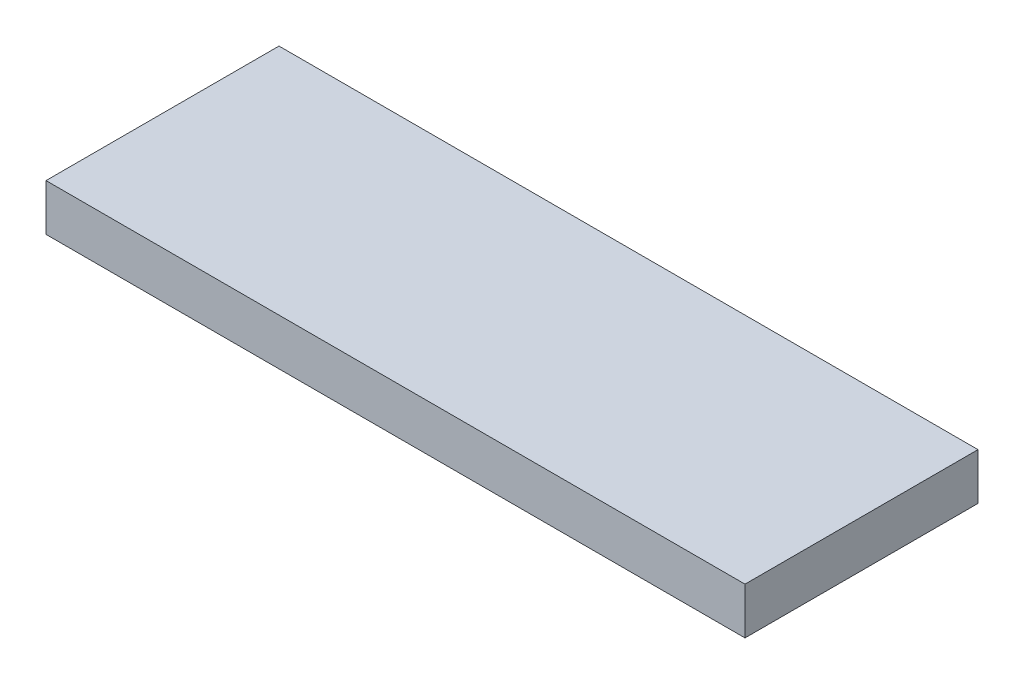
ISO-10303-21;
HEADER;
FILE_DESCRIPTION(('STEP AP214'),'2;1');
FILE_NAME('part.step','',(''),(''),'','','');
FILE_SCHEMA(('AUTOMOTIVE_DESIGN { 1 0 10303 214 1 1 1 1 }'));
ENDSEC;
DATA;
#1=APPLICATION_CONTEXT('core data for automotive mechanical design processes');
#2=APPLICATION_PROTOCOL_DEFINITION('international standard','automotive_design',2000,#1);
#3=PRODUCT_CONTEXT('',#1,'mechanical');
#4=PRODUCT('Part','Part','',(#3));
#5=PRODUCT_RELATED_PRODUCT_CATEGORY('part','',(#4));
#6=PRODUCT_DEFINITION_FORMATION('','',#4);
#7=PRODUCT_DEFINITION_CONTEXT('part definition',#1,'design');
#8=PRODUCT_DEFINITION('design','',#6,#7);
#9=PRODUCT_DEFINITION_SHAPE('','',#8);
#10=(LENGTH_UNIT() NAMED_UNIT(*) SI_UNIT(.MILLI.,.METRE.));
#11=(NAMED_UNIT(*) PLANE_ANGLE_UNIT() SI_UNIT($,.RADIAN.));
#12=(NAMED_UNIT(*) SI_UNIT($,.STERADIAN.) SOLID_ANGLE_UNIT());
#13=UNCERTAINTY_MEASURE_WITH_UNIT(LENGTH_MEASURE(1.E-05),#10,'distance_accuracy_value','');
#14=(GEOMETRIC_REPRESENTATION_CONTEXT(3) GLOBAL_UNCERTAINTY_ASSIGNED_CONTEXT((#13)) GLOBAL_UNIT_ASSIGNED_CONTEXT((#10,
#11,#12)) REPRESENTATION_CONTEXT('',''));
#15=CARTESIAN_POINT('',(0.,0.,0.));
#16=DIRECTION('',(0.,0.,1.));
#17=DIRECTION('',(1.,0.,0.));
#18=AXIS2_PLACEMENT_3D('',#15,#16,#17);
#19=CARTESIAN_POINT('',(-15.,2.,5.));
#20=DIRECTION('',(1.,0.,0.));
#21=DIRECTION('',(0.,0.,-1.));
#22=AXIS2_PLACEMENT_3D('',#19,#20,#21);
#23=PLANE('',#22);
#24=DIRECTION('',(0.,0.,1.));
#25=VECTOR('',#24,1.);
#26=CARTESIAN_POINT('',(-15.,0.,5.));
#27=LINE('',#26,#25);
#28=CARTESIAN_POINT('',(-15.,0.,-5.));
#29=VERTEX_POINT('',#28);
#30=CARTESIAN_POINT('',(-15.,0.,5.));
#31=VERTEX_POINT('',#30);
#32=EDGE_CURVE('E96',#29,#31,#27,.T.);
#33=ORIENTED_EDGE('',*,*,#32,.T.);
#34=DIRECTION('',(0.,-1.,0.));
#35=VECTOR('',#34,1.);
#36=CARTESIAN_POINT('',(-15.,2.,5.));
#37=LINE('',#36,#35);
#38=CARTESIAN_POINT('',(-15.,2.,5.));
#39=VERTEX_POINT('',#38);
#40=EDGE_CURVE('E11',#39,#31,#37,.T.);
#41=ORIENTED_EDGE('',*,*,#40,.F.);
#42=DIRECTION('',(0.,0.,1.));
#43=VECTOR('',#42,1.);
#44=CARTESIAN_POINT('',(-15.,2.,5.));
#45=LINE('',#44,#43);
#46=CARTESIAN_POINT('',(-15.,2.,-5.));
#47=VERTEX_POINT('',#46);
#48=EDGE_CURVE('E84',#47,#39,#45,.T.);
#49=ORIENTED_EDGE('',*,*,#48,.F.);
#50=DIRECTION('',(0.,-1.,0.));
#51=VECTOR('',#50,1.);
#52=CARTESIAN_POINT('',(-15.,2.,-5.));
#53=LINE('',#52,#51);
#54=EDGE_CURVE('E92',#47,#29,#53,.T.);
#55=ORIENTED_EDGE('',*,*,#54,.T.);
#56=EDGE_LOOP('',(#33,#41,#49,#55));
#57=FACE_BOUND('',#56,.T.);
#58=ADVANCED_FACE('F33',(#57),#23,.F.);
#59=CARTESIAN_POINT('',(15.,2.,5.));
#60=DIRECTION('',(0.,0.,-1.));
#61=DIRECTION('',(-1.,0.,0.));
#62=AXIS2_PLACEMENT_3D('',#59,#60,#61);
#63=PLANE('',#62);
#64=DIRECTION('',(1.,0.,0.));
#65=VECTOR('',#64,1.);
#66=CARTESIAN_POINT('',(15.,0.,5.));
#67=LINE('',#66,#65);
#68=CARTESIAN_POINT('',(15.,0.,5.));
#69=VERTEX_POINT('',#68);
#70=EDGE_CURVE('E88',#31,#69,#67,.T.);
#71=ORIENTED_EDGE('',*,*,#70,.T.);
#72=DIRECTION('',(0.,-1.,0.));
#73=VECTOR('',#72,1.);
#74=CARTESIAN_POINT('',(15.,2.,5.));
#75=LINE('',#74,#73);
#76=CARTESIAN_POINT('',(15.,2.,5.));
#77=VERTEX_POINT('',#76);
#78=EDGE_CURVE('E41',#77,#69,#75,.T.);
#79=ORIENTED_EDGE('',*,*,#78,.F.);
#80=DIRECTION('',(1.,0.,0.));
#81=VECTOR('',#80,1.);
#82=CARTESIAN_POINT('',(15.,2.,5.));
#83=LINE('',#82,#81);
#84=EDGE_CURVE('E79',#39,#77,#83,.T.);
#85=ORIENTED_EDGE('',*,*,#84,.F.);
#86=ORIENTED_EDGE('',*,*,#40,.T.);
#87=EDGE_LOOP('',(#71,#79,#85,#86));
#88=FACE_BOUND('',#87,.T.);
#89=ADVANCED_FACE('F87',(#88),#63,.F.);
#90=CARTESIAN_POINT('',(15.,2.,5.));
#91=DIRECTION('',(-1.,0.,0.));
#92=DIRECTION('',(0.,0.,1.));
#93=AXIS2_PLACEMENT_3D('',#90,#91,#92);
#94=PLANE('',#93);
#95=DIRECTION('',(0.,0.,-1.));
#96=VECTOR('',#95,1.);
#97=CARTESIAN_POINT('',(15.,0.,5.));
#98=LINE('',#97,#96);
#99=CARTESIAN_POINT('',(15.,0.,-5.));
#100=VERTEX_POINT('',#99);
#101=EDGE_CURVE('E66',#69,#100,#98,.T.);
#102=ORIENTED_EDGE('',*,*,#101,.T.);
#103=DIRECTION('',(0.,-1.,0.));
#104=VECTOR('',#103,1.);
#105=CARTESIAN_POINT('',(15.,2.,-5.));
#106=LINE('',#105,#104);
#107=CARTESIAN_POINT('',(15.,2.,-5.));
#108=VERTEX_POINT('',#107);
#109=EDGE_CURVE('E89',#108,#100,#106,.T.);
#110=ORIENTED_EDGE('',*,*,#109,.F.);
#111=DIRECTION('',(0.,0.,-1.));
#112=VECTOR('',#111,1.);
#113=CARTESIAN_POINT('',(15.,2.,5.));
#114=LINE('',#113,#112);
#115=EDGE_CURVE('E82',#77,#108,#114,.T.);
#116=ORIENTED_EDGE('',*,*,#115,.F.);
#117=ORIENTED_EDGE('',*,*,#78,.T.);
#118=EDGE_LOOP('',(#102,#110,#116,#117));
#119=FACE_BOUND('',#118,.T.);
#120=ADVANCED_FACE('F90',(#119),#94,.F.);
#121=CARTESIAN_POINT('',(15.,2.,-5.));
#122=DIRECTION('',(0.,0.,1.));
#123=DIRECTION('',(1.,0.,0.));
#124=AXIS2_PLACEMENT_3D('',#121,#122,#123);
#125=PLANE('',#124);
#126=DIRECTION('',(-1.,0.,0.));
#127=VECTOR('',#126,1.);
#128=CARTESIAN_POINT('',(15.,0.,-5.));
#129=LINE('',#128,#127);
#130=EDGE_CURVE('E72',#100,#29,#129,.T.);
#131=ORIENTED_EDGE('',*,*,#130,.T.);
#132=ORIENTED_EDGE('',*,*,#54,.F.);
#133=DIRECTION('',(-1.,0.,0.));
#134=VECTOR('',#133,1.);
#135=CARTESIAN_POINT('',(15.,2.,-5.));
#136=LINE('',#135,#134);
#137=EDGE_CURVE('E49',#108,#47,#136,.T.);
#138=ORIENTED_EDGE('',*,*,#137,.F.);
#139=ORIENTED_EDGE('',*,*,#109,.T.);
#140=EDGE_LOOP('',(#131,#132,#138,#139));
#141=FACE_BOUND('',#140,.T.);
#142=ADVANCED_FACE('F103',(#141),#125,.F.);
#143=CARTESIAN_POINT('',(0.,2.,0.));
#144=DIRECTION('',(0.,1.,0.));
#145=DIRECTION('',(0.,0.,1.));
#146=AXIS2_PLACEMENT_3D('',#143,#144,#145);
#147=PLANE('',#146);
#148=ORIENTED_EDGE('',*,*,#48,.T.);
#149=ORIENTED_EDGE('',*,*,#84,.T.);
#150=ORIENTED_EDGE('',*,*,#115,.T.);
#151=ORIENTED_EDGE('',*,*,#137,.T.);
#152=EDGE_LOOP('',(#148,#149,#150,#151));
#153=FACE_BOUND('',#152,.T.);
#154=ADVANCED_FACE('F80',(#153),#147,.T.);
#155=CARTESIAN_POINT('',(0.,0.,0.));
#156=DIRECTION('',(0.,1.,0.));
#157=DIRECTION('',(0.,0.,1.));
#158=AXIS2_PLACEMENT_3D('',#155,#156,#157);
#159=PLANE('',#158);
#160=ORIENTED_EDGE('',*,*,#32,.F.);
#161=ORIENTED_EDGE('',*,*,#130,.F.);
#162=ORIENTED_EDGE('',*,*,#101,.F.);
#163=ORIENTED_EDGE('',*,*,#70,.F.);
#164=EDGE_LOOP('',(#160,#161,#162,#163));
#165=FACE_BOUND('',#164,.T.);
#166=ADVANCED_FACE('F106',(#165),#159,.F.);
#167=CLOSED_SHELL('',(#58,#89,#120,#142,#154,#166));
#168=MANIFOLD_SOLID_BREP('B2',#167);
#169=ADVANCED_BREP_SHAPE_REPRESENTATION('',(#18,#168),#14);
#170=SHAPE_DEFINITION_REPRESENTATION(#9,#169);
ENDSEC;
END-ISO-10303-21;
